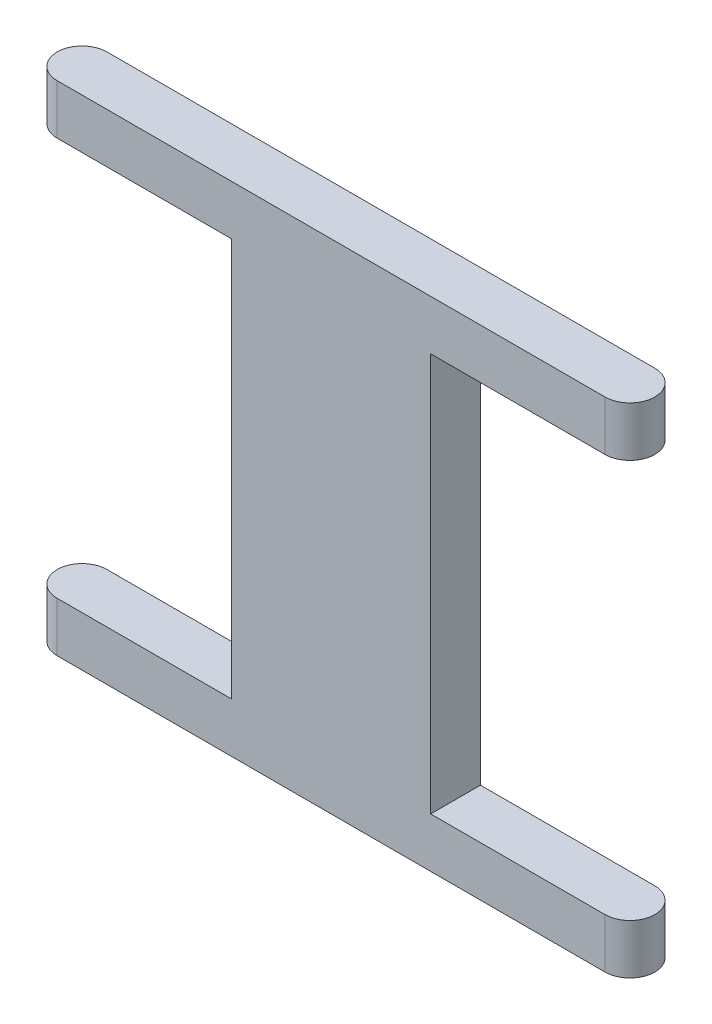
ISO-10303-21;
HEADER;
FILE_DESCRIPTION(('STEP AP214'),'2;1');
FILE_NAME('part.step','',(''),(''),'','','');
FILE_SCHEMA(('AUTOMOTIVE_DESIGN { 1 0 10303 214 1 1 1 1 }'));
ENDSEC;
DATA;
#1=APPLICATION_CONTEXT('core data for automotive mechanical design processes');
#2=APPLICATION_PROTOCOL_DEFINITION('international standard','automotive_design',2000,#1);
#3=PRODUCT_CONTEXT('',#1,'mechanical');
#4=PRODUCT('Part','Part','',(#3));
#5=PRODUCT_RELATED_PRODUCT_CATEGORY('part','',(#4));
#6=PRODUCT_DEFINITION_FORMATION('','',#4);
#7=PRODUCT_DEFINITION_CONTEXT('part definition',#1,'design');
#8=PRODUCT_DEFINITION('design','',#6,#7);
#9=PRODUCT_DEFINITION_SHAPE('','',#8);
#10=(LENGTH_UNIT() NAMED_UNIT(*) SI_UNIT(.MILLI.,.METRE.));
#11=(NAMED_UNIT(*) PLANE_ANGLE_UNIT() SI_UNIT($,.RADIAN.));
#12=(NAMED_UNIT(*) SI_UNIT($,.STERADIAN.) SOLID_ANGLE_UNIT());
#13=UNCERTAINTY_MEASURE_WITH_UNIT(LENGTH_MEASURE(1.E-05),#10,'distance_accuracy_value','');
#14=(GEOMETRIC_REPRESENTATION_CONTEXT(3) GLOBAL_UNCERTAINTY_ASSIGNED_CONTEXT((#13)) GLOBAL_UNIT_ASSIGNED_CONTEXT((#10,
#11,#12)) REPRESENTATION_CONTEXT('',''));
#15=CARTESIAN_POINT('',(0.,0.,0.));
#16=DIRECTION('',(0.,0.,1.));
#17=DIRECTION('',(1.,0.,0.));
#18=AXIS2_PLACEMENT_3D('',#15,#16,#17);
#19=CARTESIAN_POINT('',(-11.,20.,0.));
#20=DIRECTION('',(0.,-1.,0.));
#21=DIRECTION('',(0.,0.,-1.));
#22=AXIS2_PLACEMENT_3D('',#19,#20,#21);
#23=CYLINDRICAL_SURFACE('',#22,1.);
#24=CARTESIAN_POINT('',(-11.,2.,0.));
#25=DIRECTION('',(0.,-1.,0.));
#26=DIRECTION('',(1.,0.,0.));
#27=AXIS2_PLACEMENT_3D('',#24,#25,#26);
#28=CIRCLE('',#27,1.);
#29=CARTESIAN_POINT('',(-11.,2.,1.));
#30=VERTEX_POINT('',#29);
#31=CARTESIAN_POINT('',(-11.,2.,-1.));
#32=VERTEX_POINT('',#31);
#33=EDGE_CURVE('E168',#30,#32,#28,.T.);
#34=ORIENTED_EDGE('',*,*,#33,.T.);
#35=DIRECTION('',(0.,-1.,0.));
#36=VECTOR('',#35,1.);
#37=CARTESIAN_POINT('',(-11.,20.,-1.));
#38=LINE('',#37,#36);
#39=CARTESIAN_POINT('',(-11.,0.,-1.));
#40=VERTEX_POINT('',#39);
#41=EDGE_CURVE('E190',#32,#40,#38,.T.);
#42=ORIENTED_EDGE('',*,*,#41,.T.);
#43=CARTESIAN_POINT('',(-11.,0.,0.));
#44=DIRECTION('',(0.,1.,0.));
#45=DIRECTION('',(0.,0.,1.));
#46=AXIS2_PLACEMENT_3D('',#43,#44,#45);
#47=CIRCLE('',#46,1.);
#48=CARTESIAN_POINT('',(-11.,0.,1.));
#49=VERTEX_POINT('',#48);
#50=EDGE_CURVE('E179',#40,#49,#47,.T.);
#51=ORIENTED_EDGE('',*,*,#50,.T.);
#52=DIRECTION('',(0.,-1.,0.));
#53=VECTOR('',#52,1.);
#54=CARTESIAN_POINT('',(-11.,20.,1.));
#55=LINE('',#54,#53);
#56=EDGE_CURVE('E211',#30,#49,#55,.T.);
#57=ORIENTED_EDGE('',*,*,#56,.F.);
#58=EDGE_LOOP('',(#34,#42,#51,#57));
#59=FACE_BOUND('',#58,.T.);
#60=ADVANCED_FACE('F36',(#59),#23,.T.);
#61=CARTESIAN_POINT('',(11.,20.,0.));
#62=DIRECTION('',(0.,-1.,0.));
#63=DIRECTION('',(0.,0.,-1.));
#64=AXIS2_PLACEMENT_3D('',#61,#62,#63);
#65=CYLINDRICAL_SURFACE('',#64,1.);
#66=CARTESIAN_POINT('',(11.,18.,0.));
#67=DIRECTION('',(0.,1.,0.));
#68=DIRECTION('',(0.,0.,1.));
#69=AXIS2_PLACEMENT_3D('',#66,#67,#68);
#70=CIRCLE('',#69,1.);
#71=CARTESIAN_POINT('',(11.,18.,0.999999999999996));
#72=VERTEX_POINT('',#71);
#73=CARTESIAN_POINT('',(11.,18.,-1.));
#74=VERTEX_POINT('',#73);
#75=EDGE_CURVE('E174',#72,#74,#70,.T.);
#76=ORIENTED_EDGE('',*,*,#75,.T.);
#77=DIRECTION('',(0.,-1.,0.));
#78=VECTOR('',#77,1.);
#79=CARTESIAN_POINT('',(11.,20.,-1.));
#80=LINE('',#79,#78);
#81=CARTESIAN_POINT('',(11.,20.,-1.));
#82=VERTEX_POINT('',#81);
#83=EDGE_CURVE('E205',#82,#74,#80,.T.);
#84=ORIENTED_EDGE('',*,*,#83,.F.);
#85=CARTESIAN_POINT('',(11.,20.,0.));
#86=DIRECTION('',(0.,1.,0.));
#87=DIRECTION('',(0.,0.,1.));
#88=AXIS2_PLACEMENT_3D('',#85,#86,#87);
#89=CIRCLE('',#88,1.);
#90=CARTESIAN_POINT('',(11.,20.,0.999999999999996));
#91=VERTEX_POINT('',#90);
#92=EDGE_CURVE('E186',#91,#82,#89,.T.);
#93=ORIENTED_EDGE('',*,*,#92,.F.);
#94=DIRECTION('',(0.,-1.,0.));
#95=VECTOR('',#94,1.);
#96=CARTESIAN_POINT('',(11.,20.,0.999999999999996));
#97=LINE('',#96,#95);
#98=EDGE_CURVE('E208',#91,#72,#97,.T.);
#99=ORIENTED_EDGE('',*,*,#98,.T.);
#100=EDGE_LOOP('',(#76,#84,#93,#99));
#101=FACE_BOUND('',#100,.T.);
#102=ADVANCED_FACE('F228',(#101),#65,.T.);
#103=CARTESIAN_POINT('',(-11.,18.,0.));
#104=DIRECTION('',(0.,1.,0.));
#105=DIRECTION('',(-1.,0.,0.));
#106=AXIS2_PLACEMENT_3D('',#103,#104,#105);
#107=CIRCLE('',#106,1.);
#108=CARTESIAN_POINT('',(-11.,18.,-1.));
#109=VERTEX_POINT('',#108);
#110=CARTESIAN_POINT('',(-11.,18.,1.));
#111=VERTEX_POINT('',#110);
#112=EDGE_CURVE('E58',#109,#111,#107,.T.);
#113=ORIENTED_EDGE('',*,*,#112,.T.);
#114=CARTESIAN_POINT('',(-11.,20.,1.));
#115=VERTEX_POINT('',#114);
#116=EDGE_CURVE('E212',#115,#111,#55,.T.);
#117=ORIENTED_EDGE('',*,*,#116,.F.);
#118=CARTESIAN_POINT('',(-11.,20.,0.));
#119=DIRECTION('',(0.,1.,0.));
#120=DIRECTION('',(0.,0.,1.));
#121=AXIS2_PLACEMENT_3D('',#118,#119,#120);
#122=CIRCLE('',#121,1.);
#123=CARTESIAN_POINT('',(-11.,20.,-1.));
#124=VERTEX_POINT('',#123);
#125=EDGE_CURVE('E180',#124,#115,#122,.T.);
#126=ORIENTED_EDGE('',*,*,#125,.F.);
#127=EDGE_CURVE('E201',#124,#109,#38,.T.);
#128=ORIENTED_EDGE('',*,*,#127,.T.);
#129=EDGE_LOOP('',(#113,#117,#126,#128));
#130=FACE_BOUND('',#129,.T.);
#131=ADVANCED_FACE('F38',(#130),#23,.T.);
#132=CARTESIAN_POINT('',(-11.,20.,1.));
#133=DIRECTION('',(0.,0.,-1.));
#134=DIRECTION('',(-1.,0.,0.));
#135=AXIS2_PLACEMENT_3D('',#132,#133,#134);
#136=PLANE('',#135);
#137=DIRECTION('',(0.,1.,0.));
#138=VECTOR('',#137,1.);
#139=CARTESIAN_POINT('',(4.,20.,0.999999999999997));
#140=LINE('',#139,#138);
#141=CARTESIAN_POINT('',(4.,2.,0.999999999999996));
#142=VERTEX_POINT('',#141);
#143=CARTESIAN_POINT('',(4.,18.,0.999999999999997));
#144=VERTEX_POINT('',#143);
#145=EDGE_CURVE('E133',#142,#144,#140,.T.);
#146=ORIENTED_EDGE('',*,*,#145,.T.);
#147=DIRECTION('',(1.,0.,0.));
#148=VECTOR('',#147,1.);
#149=CARTESIAN_POINT('',(-11.,18.,1.));
#150=LINE('',#149,#148);
#151=EDGE_CURVE('E176',#144,#72,#150,.T.);
#152=ORIENTED_EDGE('',*,*,#151,.T.);
#153=ORIENTED_EDGE('',*,*,#98,.F.);
#154=DIRECTION('',(1.,0.,0.));
#155=VECTOR('',#154,1.);
#156=CARTESIAN_POINT('',(-11.,20.,1.));
#157=LINE('',#156,#155);
#158=EDGE_CURVE('E183',#115,#91,#157,.T.);
#159=ORIENTED_EDGE('',*,*,#158,.F.);
#160=ORIENTED_EDGE('',*,*,#116,.T.);
#161=DIRECTION('',(1.,0.,0.));
#162=VECTOR('',#161,1.);
#163=CARTESIAN_POINT('',(-11.,18.,1.));
#164=LINE('',#163,#162);
#165=CARTESIAN_POINT('',(-4.,18.,0.999999999999999));
#166=VERTEX_POINT('',#165);
#167=EDGE_CURVE('E150',#111,#166,#164,.T.);
#168=ORIENTED_EDGE('',*,*,#167,.T.);
#169=DIRECTION('',(0.,-1.,0.));
#170=VECTOR('',#169,1.);
#171=CARTESIAN_POINT('',(-4.,20.,0.999999999999999));
#172=LINE('',#171,#170);
#173=CARTESIAN_POINT('',(-4.,2.,0.999999999999999));
#174=VERTEX_POINT('',#173);
#175=EDGE_CURVE('E162',#166,#174,#172,.T.);
#176=ORIENTED_EDGE('',*,*,#175,.T.);
#177=DIRECTION('',(-1.,0.,0.));
#178=VECTOR('',#177,1.);
#179=CARTESIAN_POINT('',(-11.,2.,1.));
#180=LINE('',#179,#178);
#181=EDGE_CURVE('E165',#174,#30,#180,.T.);
#182=ORIENTED_EDGE('',*,*,#181,.T.);
#183=ORIENTED_EDGE('',*,*,#56,.T.);
#184=DIRECTION('',(1.,0.,0.));
#185=VECTOR('',#184,1.);
#186=CARTESIAN_POINT('',(-11.,0.,1.));
#187=LINE('',#186,#185);
#188=CARTESIAN_POINT('',(11.,0.,0.999999999999996));
#189=VERTEX_POINT('',#188);
#190=EDGE_CURVE('E193',#49,#189,#187,.T.);
#191=ORIENTED_EDGE('',*,*,#190,.T.);
#192=CARTESIAN_POINT('',(11.,2.,0.999999999999996));
#193=VERTEX_POINT('',#192);
#194=EDGE_CURVE('E207',#193,#189,#97,.T.);
#195=ORIENTED_EDGE('',*,*,#194,.F.);
#196=DIRECTION('',(-1.,0.,0.));
#197=VECTOR('',#196,1.);
#198=CARTESIAN_POINT('',(-11.,2.,1.));
#199=LINE('',#198,#197);
#200=EDGE_CURVE('E171',#193,#142,#199,.T.);
#201=ORIENTED_EDGE('',*,*,#200,.T.);
#202=EDGE_LOOP('',(#146,#152,#153,#159,#160,#168,#176,#182,#183,#191,#195,#201));
#203=FACE_BOUND('',#202,.T.);
#204=ADVANCED_FACE('F232',(#203),#136,.F.);
#205=CARTESIAN_POINT('',(11.,2.,-1.));
#206=VERTEX_POINT('',#205);
#207=CARTESIAN_POINT('',(11.,0.,-1.));
#208=VERTEX_POINT('',#207);
#209=EDGE_CURVE('E204',#206,#208,#80,.T.);
#210=ORIENTED_EDGE('',*,*,#209,.F.);
#211=CARTESIAN_POINT('',(11.,2.,0.));
#212=DIRECTION('',(0.,-1.,0.));
#213=DIRECTION('',(0.,0.,-1.));
#214=AXIS2_PLACEMENT_3D('',#211,#212,#213);
#215=CIRCLE('',#214,1.);
#216=EDGE_CURVE('E51',#206,#193,#215,.T.);
#217=ORIENTED_EDGE('',*,*,#216,.T.);
#218=ORIENTED_EDGE('',*,*,#194,.T.);
#219=CARTESIAN_POINT('',(11.,0.,0.));
#220=DIRECTION('',(0.,1.,0.));
#221=DIRECTION('',(0.,0.,1.));
#222=AXIS2_PLACEMENT_3D('',#219,#220,#221);
#223=CIRCLE('',#222,1.);
#224=EDGE_CURVE('E196',#189,#208,#223,.T.);
#225=ORIENTED_EDGE('',*,*,#224,.T.);
#226=EDGE_LOOP('',(#210,#217,#218,#225));
#227=FACE_BOUND('',#226,.T.);
#228=ADVANCED_FACE('F235',(#227),#65,.T.);
#229=CARTESIAN_POINT('',(-11.,20.,-1.));
#230=DIRECTION('',(0.,0.,1.));
#231=DIRECTION('',(1.,0.,0.));
#232=AXIS2_PLACEMENT_3D('',#229,#230,#231);
#233=PLANE('',#232);
#234=ORIENTED_EDGE('',*,*,#83,.T.);
#235=DIRECTION('',(1.,0.,0.));
#236=VECTOR('',#235,1.);
#237=CARTESIAN_POINT('',(12.,18.,-1.));
#238=LINE('',#237,#236);
#239=CARTESIAN_POINT('',(4.,18.,-1.));
#240=VERTEX_POINT('',#239);
#241=EDGE_CURVE('E136',#240,#74,#238,.T.);
#242=ORIENTED_EDGE('',*,*,#241,.F.);
#243=DIRECTION('',(0.,1.,0.));
#244=VECTOR('',#243,1.);
#245=CARTESIAN_POINT('',(4.,18.,-1.));
#246=LINE('',#245,#244);
#247=CARTESIAN_POINT('',(4.,2.,-1.));
#248=VERTEX_POINT('',#247);
#249=EDGE_CURVE('E130',#248,#240,#246,.T.);
#250=ORIENTED_EDGE('',*,*,#249,.F.);
#251=DIRECTION('',(1.,0.,0.));
#252=VECTOR('',#251,1.);
#253=CARTESIAN_POINT('',(-11.,2.,-1.));
#254=LINE('',#253,#252);
#255=EDGE_CURVE('E11',#248,#206,#254,.T.);
#256=ORIENTED_EDGE('',*,*,#255,.T.);
#257=ORIENTED_EDGE('',*,*,#209,.T.);
#258=DIRECTION('',(-1.,0.,0.));
#259=VECTOR('',#258,1.);
#260=CARTESIAN_POINT('',(-11.,0.,-1.));
#261=LINE('',#260,#259);
#262=EDGE_CURVE('E184',#208,#40,#261,.T.);
#263=ORIENTED_EDGE('',*,*,#262,.T.);
#264=ORIENTED_EDGE('',*,*,#41,.F.);
#265=DIRECTION('',(-1.,0.,0.));
#266=VECTOR('',#265,1.);
#267=CARTESIAN_POINT('',(-12.,2.,-1.));
#268=LINE('',#267,#266);
#269=CARTESIAN_POINT('',(-4.,2.,-1.));
#270=VERTEX_POINT('',#269);
#271=EDGE_CURVE('E155',#270,#32,#268,.T.);
#272=ORIENTED_EDGE('',*,*,#271,.F.);
#273=DIRECTION('',(0.,-1.,0.));
#274=VECTOR('',#273,1.);
#275=CARTESIAN_POINT('',(-4.,18.,-1.));
#276=LINE('',#275,#274);
#277=CARTESIAN_POINT('',(-4.,18.,-1.));
#278=VERTEX_POINT('',#277);
#279=EDGE_CURVE('E152',#278,#270,#276,.T.);
#280=ORIENTED_EDGE('',*,*,#279,.F.);
#281=DIRECTION('',(-1.,0.,0.));
#282=VECTOR('',#281,1.);
#283=CARTESIAN_POINT('',(-11.,18.,-1.));
#284=LINE('',#283,#282);
#285=EDGE_CURVE('E44',#278,#109,#284,.T.);
#286=ORIENTED_EDGE('',*,*,#285,.T.);
#287=ORIENTED_EDGE('',*,*,#127,.F.);
#288=DIRECTION('',(-1.,0.,0.));
#289=VECTOR('',#288,1.);
#290=CARTESIAN_POINT('',(-11.,20.,-1.));
#291=LINE('',#290,#289);
#292=EDGE_CURVE('E188',#82,#124,#291,.T.);
#293=ORIENTED_EDGE('',*,*,#292,.F.);
#294=EDGE_LOOP('',(#234,#242,#250,#256,#257,#263,#264,#272,#280,#286,#287,#293));
#295=FACE_BOUND('',#294,.T.);
#296=ADVANCED_FACE('F142',(#295),#233,.F.);
#297=CARTESIAN_POINT('',(-11.,20.,0.));
#298=DIRECTION('',(0.,1.,0.));
#299=DIRECTION('',(0.,0.,1.));
#300=AXIS2_PLACEMENT_3D('',#297,#298,#299);
#301=PLANE('',#300);
#302=ORIENTED_EDGE('',*,*,#125,.T.);
#303=ORIENTED_EDGE('',*,*,#158,.T.);
#304=ORIENTED_EDGE('',*,*,#92,.T.);
#305=ORIENTED_EDGE('',*,*,#292,.T.);
#306=EDGE_LOOP('',(#302,#303,#304,#305));
#307=FACE_BOUND('',#306,.T.);
#308=ADVANCED_FACE('F223',(#307),#301,.T.);
#309=CARTESIAN_POINT('',(-11.,0.,0.));
#310=DIRECTION('',(0.,1.,0.));
#311=DIRECTION('',(0.,0.,1.));
#312=AXIS2_PLACEMENT_3D('',#309,#310,#311);
#313=PLANE('',#312);
#314=ORIENTED_EDGE('',*,*,#50,.F.);
#315=ORIENTED_EDGE('',*,*,#262,.F.);
#316=ORIENTED_EDGE('',*,*,#224,.F.);
#317=ORIENTED_EDGE('',*,*,#190,.F.);
#318=EDGE_LOOP('',(#314,#315,#316,#317));
#319=FACE_BOUND('',#318,.T.);
#320=ADVANCED_FACE('F242',(#319),#313,.F.);
#321=CARTESIAN_POINT('',(-12.,2.,11.));
#322=DIRECTION('',(0.,-1.,0.));
#323=DIRECTION('',(1.,0.,0.));
#324=AXIS2_PLACEMENT_3D('',#321,#322,#323);
#325=PLANE('',#324);
#326=ORIENTED_EDGE('',*,*,#33,.F.);
#327=ORIENTED_EDGE('',*,*,#181,.F.);
#328=DIRECTION('',(0.,0.,-1.));
#329=VECTOR('',#328,1.);
#330=CARTESIAN_POINT('',(-4.,2.,11.));
#331=LINE('',#330,#329);
#332=EDGE_CURVE('E144',#174,#270,#331,.T.);
#333=ORIENTED_EDGE('',*,*,#332,.T.);
#334=ORIENTED_EDGE('',*,*,#271,.T.);
#335=EDGE_LOOP('',(#326,#327,#333,#334));
#336=FACE_BOUND('',#335,.T.);
#337=ADVANCED_FACE('F246',(#336),#325,.F.);
#338=CARTESIAN_POINT('',(-3.99999999999999,18.,11.));
#339=DIRECTION('',(1.,0.,0.));
#340=DIRECTION('',(0.,0.,-1.));
#341=AXIS2_PLACEMENT_3D('',#338,#339,#340);
#342=PLANE('',#341);
#343=DIRECTION('',(0.,0.,-1.));
#344=VECTOR('',#343,1.);
#345=CARTESIAN_POINT('',(-3.99999999999999,18.,11.));
#346=LINE('',#345,#344);
#347=EDGE_CURVE('E147',#166,#278,#346,.T.);
#348=ORIENTED_EDGE('',*,*,#347,.T.);
#349=ORIENTED_EDGE('',*,*,#279,.T.);
#350=ORIENTED_EDGE('',*,*,#332,.F.);
#351=ORIENTED_EDGE('',*,*,#175,.F.);
#352=EDGE_LOOP('',(#348,#349,#350,#351));
#353=FACE_BOUND('',#352,.T.);
#354=ADVANCED_FACE('F249',(#353),#342,.F.);
#355=CARTESIAN_POINT('',(-12.,18.,11.));
#356=DIRECTION('',(0.,1.,0.));
#357=DIRECTION('',(-1.,0.,0.));
#358=AXIS2_PLACEMENT_3D('',#355,#356,#357);
#359=PLANE('',#358);
#360=ORIENTED_EDGE('',*,*,#285,.F.);
#361=ORIENTED_EDGE('',*,*,#347,.F.);
#362=ORIENTED_EDGE('',*,*,#167,.F.);
#363=ORIENTED_EDGE('',*,*,#112,.F.);
#364=EDGE_LOOP('',(#360,#361,#362,#363));
#365=FACE_BOUND('',#364,.T.);
#366=ADVANCED_FACE('F250',(#365),#359,.F.);
#367=CARTESIAN_POINT('',(12.,18.,11.));
#368=DIRECTION('',(0.,1.,0.));
#369=DIRECTION('',(0.,0.,1.));
#370=AXIS2_PLACEMENT_3D('',#367,#368,#369);
#371=PLANE('',#370);
#372=DIRECTION('',(0.,0.,-1.));
#373=VECTOR('',#372,1.);
#374=CARTESIAN_POINT('',(4.,18.,11.));
#375=LINE('',#374,#373);
#376=EDGE_CURVE('E135',#144,#240,#375,.T.);
#377=ORIENTED_EDGE('',*,*,#376,.T.);
#378=ORIENTED_EDGE('',*,*,#241,.T.);
#379=ORIENTED_EDGE('',*,*,#75,.F.);
#380=ORIENTED_EDGE('',*,*,#151,.F.);
#381=EDGE_LOOP('',(#377,#378,#379,#380));
#382=FACE_BOUND('',#381,.T.);
#383=ADVANCED_FACE('F230',(#382),#371,.F.);
#384=CARTESIAN_POINT('',(4.,18.,11.));
#385=DIRECTION('',(-1.,0.,0.));
#386=DIRECTION('',(0.,0.,1.));
#387=AXIS2_PLACEMENT_3D('',#384,#385,#386);
#388=PLANE('',#387);
#389=DIRECTION('',(0.,0.,-1.));
#390=VECTOR('',#389,1.);
#391=CARTESIAN_POINT('',(4.,2.,11.));
#392=LINE('',#391,#390);
#393=EDGE_CURVE('E126',#142,#248,#392,.T.);
#394=ORIENTED_EDGE('',*,*,#393,.T.);
#395=ORIENTED_EDGE('',*,*,#249,.T.);
#396=ORIENTED_EDGE('',*,*,#376,.F.);
#397=ORIENTED_EDGE('',*,*,#145,.F.);
#398=EDGE_LOOP('',(#394,#395,#396,#397));
#399=FACE_BOUND('',#398,.T.);
#400=ADVANCED_FACE('F127',(#399),#388,.F.);
#401=CARTESIAN_POINT('',(12.,2.,11.));
#402=DIRECTION('',(0.,-1.,0.));
#403=DIRECTION('',(0.,0.,-1.));
#404=AXIS2_PLACEMENT_3D('',#401,#402,#403);
#405=PLANE('',#404);
#406=ORIENTED_EDGE('',*,*,#216,.F.);
#407=ORIENTED_EDGE('',*,*,#255,.F.);
#408=ORIENTED_EDGE('',*,*,#393,.F.);
#409=ORIENTED_EDGE('',*,*,#200,.F.);
#410=EDGE_LOOP('',(#406,#407,#408,#409));
#411=FACE_BOUND('',#410,.T.);
#412=ADVANCED_FACE('F138',(#411),#405,.F.);
#413=CLOSED_SHELL('',(#60,#102,#131,#204,#228,#296,#308,#320,#337,#354,#366,#383,#400,#412));
#414=MANIFOLD_SOLID_BREP('B2',#413);
#415=ADVANCED_BREP_SHAPE_REPRESENTATION('',(#18,#414),#14);
#416=SHAPE_DEFINITION_REPRESENTATION(#9,#415);
ENDSEC;
END-ISO-10303-21;
